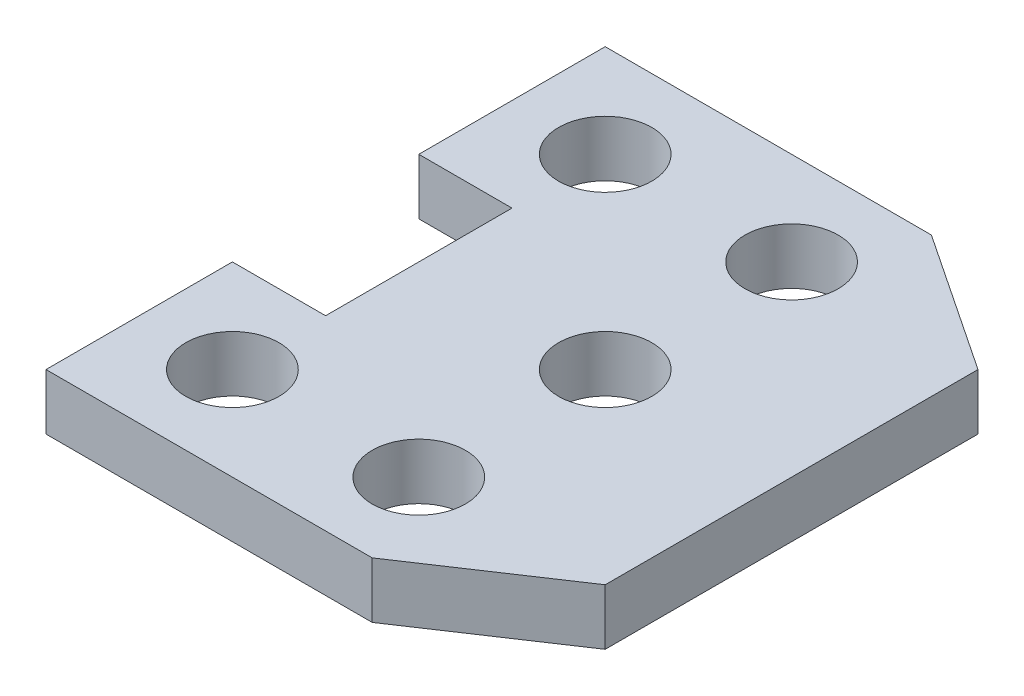
ISO-10303-21;
HEADER;
FILE_DESCRIPTION(('STEP AP214'),'2;1');
FILE_NAME('part.step','',(''),(''),'','','');
FILE_SCHEMA(('AUTOMOTIVE_DESIGN { 1 0 10303 214 1 1 1 1 }'));
ENDSEC;
DATA;
#1=APPLICATION_CONTEXT('core data for automotive mechanical design processes');
#2=APPLICATION_PROTOCOL_DEFINITION('international standard','automotive_design',2000,#1);
#3=PRODUCT_CONTEXT('',#1,'mechanical');
#4=PRODUCT('Part','Part','',(#3));
#5=PRODUCT_RELATED_PRODUCT_CATEGORY('part','',(#4));
#6=PRODUCT_DEFINITION_FORMATION('','',#4);
#7=PRODUCT_DEFINITION_CONTEXT('part definition',#1,'design');
#8=PRODUCT_DEFINITION('design','',#6,#7);
#9=PRODUCT_DEFINITION_SHAPE('','',#8);
#10=(LENGTH_UNIT() NAMED_UNIT(*) SI_UNIT(.MILLI.,.METRE.));
#11=(NAMED_UNIT(*) PLANE_ANGLE_UNIT() SI_UNIT($,.RADIAN.));
#12=(NAMED_UNIT(*) SI_UNIT($,.STERADIAN.) SOLID_ANGLE_UNIT());
#13=UNCERTAINTY_MEASURE_WITH_UNIT(LENGTH_MEASURE(1.E-05),#10,'distance_accuracy_value','');
#14=(GEOMETRIC_REPRESENTATION_CONTEXT(3) GLOBAL_UNCERTAINTY_ASSIGNED_CONTEXT((#13)) GLOBAL_UNIT_ASSIGNED_CONTEXT((#10,
#11,#12)) REPRESENTATION_CONTEXT('',''));
#15=CARTESIAN_POINT('',(0.,0.,0.));
#16=DIRECTION('',(0.,0.,1.));
#17=DIRECTION('',(1.,0.,0.));
#18=AXIS2_PLACEMENT_3D('',#15,#16,#17);
#19=CARTESIAN_POINT('',(0.,12.,0.));
#20=DIRECTION('',(0.,-1.,0.));
#21=DIRECTION('',(0.,0.,-1.));
#22=AXIS2_PLACEMENT_3D('',#19,#20,#21);
#23=PLANE('',#22);
#24=DIRECTION('',(0.832050294337844,0.,-0.554700196225229));
#25=VECTOR('',#24,1.);
#26=CARTESIAN_POINT('',(0.,12.,0.));
#27=LINE('',#26,#25);
#28=CARTESIAN_POINT('',(0.,12.,0.));
#29=VERTEX_POINT('',#28);
#30=CARTESIAN_POINT('',(30.,12.,-20.));
#31=VERTEX_POINT('',#30);
#32=EDGE_CURVE('E164',#29,#31,#27,.T.);
#33=ORIENTED_EDGE('',*,*,#32,.T.);
#34=DIRECTION('',(0.,0.,-1.));
#35=VECTOR('',#34,1.);
#36=CARTESIAN_POINT('',(30.,12.,-100.));
#37=LINE('',#36,#35);
#38=CARTESIAN_POINT('',(30.,12.,-100.));
#39=VERTEX_POINT('',#38);
#40=EDGE_CURVE('E102',#31,#39,#37,.T.);
#41=ORIENTED_EDGE('',*,*,#40,.T.);
#42=DIRECTION('',(-0.832050294337845,0.,-0.554700196225227));
#43=VECTOR('',#42,1.);
#44=CARTESIAN_POINT('',(-1.76941794549634E-13,12.,-120.));
#45=LINE('',#44,#43);
#46=CARTESIAN_POINT('',(-1.76941794549634E-13,12.,-120.));
#47=VERTEX_POINT('',#46);
#48=EDGE_CURVE('E185',#39,#47,#45,.T.);
#49=ORIENTED_EDGE('',*,*,#48,.T.);
#50=DIRECTION('',(-1.,0.,0.));
#51=VECTOR('',#50,1.);
#52=CARTESIAN_POINT('',(-70.,12.,-120.));
#53=LINE('',#52,#51);
#54=CARTESIAN_POINT('',(-70.,12.,-120.));
#55=VERTEX_POINT('',#54);
#56=EDGE_CURVE('E204',#47,#55,#53,.T.);
#57=ORIENTED_EDGE('',*,*,#56,.T.);
#58=DIRECTION('',(0.,0.,1.));
#59=VECTOR('',#58,1.);
#60=CARTESIAN_POINT('',(-70.,12.,-80.));
#61=LINE('',#60,#59);
#62=CARTESIAN_POINT('',(-70.,12.,-80.));
#63=VERTEX_POINT('',#62);
#64=EDGE_CURVE('E201',#55,#63,#61,.T.);
#65=ORIENTED_EDGE('',*,*,#64,.T.);
#66=DIRECTION('',(1.,0.,0.));
#67=VECTOR('',#66,1.);
#68=CARTESIAN_POINT('',(-50.,12.,-80.));
#69=LINE('',#68,#67);
#70=CARTESIAN_POINT('',(-50.,12.,-80.));
#71=VERTEX_POINT('',#70);
#72=EDGE_CURVE('E203',#63,#71,#69,.T.);
#73=ORIENTED_EDGE('',*,*,#72,.T.);
#74=DIRECTION('',(0.,0.,1.));
#75=VECTOR('',#74,1.);
#76=CARTESIAN_POINT('',(-50.,12.,-40.));
#77=LINE('',#76,#75);
#78=CARTESIAN_POINT('',(-50.,12.,-40.));
#79=VERTEX_POINT('',#78);
#80=EDGE_CURVE('E127',#71,#79,#77,.T.);
#81=ORIENTED_EDGE('',*,*,#80,.T.);
#82=DIRECTION('',(-1.,0.,0.));
#83=VECTOR('',#82,1.);
#84=CARTESIAN_POINT('',(-70.,12.,-40.));
#85=LINE('',#84,#83);
#86=CARTESIAN_POINT('',(-70.,12.,-40.));
#87=VERTEX_POINT('',#86);
#88=EDGE_CURVE('E121',#79,#87,#85,.T.);
#89=ORIENTED_EDGE('',*,*,#88,.T.);
#90=DIRECTION('',(0.,0.,1.));
#91=VECTOR('',#90,1.);
#92=CARTESIAN_POINT('',(-70.,12.,0.));
#93=LINE('',#92,#91);
#94=CARTESIAN_POINT('',(-70.,12.,0.));
#95=VERTEX_POINT('',#94);
#96=EDGE_CURVE('E125',#87,#95,#93,.T.);
#97=ORIENTED_EDGE('',*,*,#96,.T.);
#98=DIRECTION('',(1.,0.,0.));
#99=VECTOR('',#98,1.);
#100=CARTESIAN_POINT('',(0.,12.,0.));
#101=LINE('',#100,#99);
#102=EDGE_CURVE('E53',#95,#29,#101,.T.);
#103=ORIENTED_EDGE('',*,*,#102,.T.);
#104=EDGE_LOOP('',(#33,#41,#49,#57,#65,#73,#81,#89,#97,#103));
#105=FACE_BOUND('',#104,.T.);
#106=CARTESIAN_POINT('',(-10.,12.,-100.));
#107=DIRECTION('',(0.,1.,0.));
#108=DIRECTION('',(0.,0.,1.));
#109=AXIS2_PLACEMENT_3D('',#106,#107,#108);
#110=CIRCLE('',#109,10.);
#111=CARTESIAN_POINT('',(-10.,12.,-90.));
#112=VERTEX_POINT('',#111);
#113=EDGE_CURVE('E149',#112,#112,#110,.T.);
#114=ORIENTED_EDGE('',*,*,#113,.F.);
#115=EDGE_LOOP('',(#114));
#116=FACE_BOUND('',#115,.T.);
#117=CARTESIAN_POINT('',(-50.,12.,-100.));
#118=DIRECTION('',(0.,1.,0.));
#119=DIRECTION('',(0.,0.,1.));
#120=AXIS2_PLACEMENT_3D('',#117,#118,#119);
#121=CIRCLE('',#120,10.);
#122=CARTESIAN_POINT('',(-50.,12.,-90.));
#123=VERTEX_POINT('',#122);
#124=EDGE_CURVE('E215',#123,#123,#121,.T.);
#125=ORIENTED_EDGE('',*,*,#124,.F.);
#126=EDGE_LOOP('',(#125));
#127=FACE_BOUND('',#126,.T.);
#128=CARTESIAN_POINT('',(-50.,12.,-20.));
#129=DIRECTION('',(0.,1.,0.));
#130=DIRECTION('',(0.,0.,1.));
#131=AXIS2_PLACEMENT_3D('',#128,#129,#130);
#132=CIRCLE('',#131,10.);
#133=CARTESIAN_POINT('',(-50.,12.,-9.99999999999999));
#134=VERTEX_POINT('',#133);
#135=EDGE_CURVE('E221',#134,#134,#132,.T.);
#136=ORIENTED_EDGE('',*,*,#135,.F.);
#137=EDGE_LOOP('',(#136));
#138=FACE_BOUND('',#137,.T.);
#139=CARTESIAN_POINT('',(-10.,12.,-20.));
#140=DIRECTION('',(0.,1.,0.));
#141=DIRECTION('',(0.,0.,1.));
#142=AXIS2_PLACEMENT_3D('',#139,#140,#141);
#143=CIRCLE('',#142,10.);
#144=CARTESIAN_POINT('',(-10.,12.,-9.99999999999999));
#145=VERTEX_POINT('',#144);
#146=EDGE_CURVE('E227',#145,#145,#143,.T.);
#147=ORIENTED_EDGE('',*,*,#146,.F.);
#148=EDGE_LOOP('',(#147));
#149=FACE_BOUND('',#148,.T.);
#150=CARTESIAN_POINT('',(-10.,12.,-60.));
#151=DIRECTION('',(0.,1.,0.));
#152=DIRECTION('',(0.,0.,1.));
#153=AXIS2_PLACEMENT_3D('',#150,#151,#152);
#154=CIRCLE('',#153,10.);
#155=CARTESIAN_POINT('',(-10.,12.,-50.));
#156=VERTEX_POINT('',#155);
#157=EDGE_CURVE('E233',#156,#156,#154,.T.);
#158=ORIENTED_EDGE('',*,*,#157,.F.);
#159=EDGE_LOOP('',(#158));
#160=FACE_BOUND('',#159,.T.);
#161=ADVANCED_FACE('F36',(#105,#116,#127,#138,#149,#160),#23,.F.);
#162=CARTESIAN_POINT('',(0.,0.,0.));
#163=DIRECTION('',(0.,-1.,0.));
#164=DIRECTION('',(0.,0.,-1.));
#165=AXIS2_PLACEMENT_3D('',#162,#163,#164);
#166=PLANE('',#165);
#167=CARTESIAN_POINT('',(-10.,0.,-20.));
#168=DIRECTION('',(0.,1.,0.));
#169=DIRECTION('',(0.,0.,1.));
#170=AXIS2_PLACEMENT_3D('',#167,#168,#169);
#171=CIRCLE('',#170,10.);
#172=CARTESIAN_POINT('',(-10.,0.,-9.99999999999999));
#173=VERTEX_POINT('',#172);
#174=EDGE_CURVE('E230',#173,#173,#171,.T.);
#175=ORIENTED_EDGE('',*,*,#174,.T.);
#176=EDGE_LOOP('',(#175));
#177=FACE_BOUND('',#176,.T.);
#178=CARTESIAN_POINT('',(-50.,0.,-100.));
#179=DIRECTION('',(0.,1.,0.));
#180=DIRECTION('',(0.,0.,1.));
#181=AXIS2_PLACEMENT_3D('',#178,#179,#180);
#182=CIRCLE('',#181,10.);
#183=CARTESIAN_POINT('',(-50.,0.,-90.));
#184=VERTEX_POINT('',#183);
#185=EDGE_CURVE('E218',#184,#184,#182,.T.);
#186=ORIENTED_EDGE('',*,*,#185,.T.);
#187=EDGE_LOOP('',(#186));
#188=FACE_BOUND('',#187,.T.);
#189=DIRECTION('',(0.832050294337844,0.,-0.554700196225229));
#190=VECTOR('',#189,1.);
#191=CARTESIAN_POINT('',(0.,0.,0.));
#192=LINE('',#191,#190);
#193=CARTESIAN_POINT('',(0.,0.,0.));
#194=VERTEX_POINT('',#193);
#195=CARTESIAN_POINT('',(30.,0.,-20.));
#196=VERTEX_POINT('',#195);
#197=EDGE_CURVE('E145',#194,#196,#192,.T.);
#198=ORIENTED_EDGE('',*,*,#197,.F.);
#199=DIRECTION('',(1.,0.,0.));
#200=VECTOR('',#199,1.);
#201=CARTESIAN_POINT('',(0.,0.,0.));
#202=LINE('',#201,#200);
#203=CARTESIAN_POINT('',(-70.,0.,0.));
#204=VERTEX_POINT('',#203);
#205=EDGE_CURVE('E94',#204,#194,#202,.T.);
#206=ORIENTED_EDGE('',*,*,#205,.F.);
#207=DIRECTION('',(0.,0.,1.));
#208=VECTOR('',#207,1.);
#209=CARTESIAN_POINT('',(-70.,0.,0.));
#210=LINE('',#209,#208);
#211=CARTESIAN_POINT('',(-70.,0.,-40.));
#212=VERTEX_POINT('',#211);
#213=EDGE_CURVE('E88',#212,#204,#210,.T.);
#214=ORIENTED_EDGE('',*,*,#213,.F.);
#215=DIRECTION('',(-1.,0.,0.));
#216=VECTOR('',#215,1.);
#217=CARTESIAN_POINT('',(-70.,0.,-40.));
#218=LINE('',#217,#216);
#219=CARTESIAN_POINT('',(-50.,0.,-40.));
#220=VERTEX_POINT('',#219);
#221=EDGE_CURVE('E135',#220,#212,#218,.T.);
#222=ORIENTED_EDGE('',*,*,#221,.F.);
#223=DIRECTION('',(0.,0.,1.));
#224=VECTOR('',#223,1.);
#225=CARTESIAN_POINT('',(-50.,0.,-40.));
#226=LINE('',#225,#224);
#227=CARTESIAN_POINT('',(-50.,0.,-80.));
#228=VERTEX_POINT('',#227);
#229=EDGE_CURVE('E159',#228,#220,#226,.T.);
#230=ORIENTED_EDGE('',*,*,#229,.F.);
#231=DIRECTION('',(1.,0.,0.));
#232=VECTOR('',#231,1.);
#233=CARTESIAN_POINT('',(-50.,0.,-80.));
#234=LINE('',#233,#232);
#235=CARTESIAN_POINT('',(-70.,0.,-80.));
#236=VERTEX_POINT('',#235);
#237=EDGE_CURVE('E157',#236,#228,#234,.T.);
#238=ORIENTED_EDGE('',*,*,#237,.F.);
#239=DIRECTION('',(0.,0.,1.));
#240=VECTOR('',#239,1.);
#241=CARTESIAN_POINT('',(-70.,0.,-80.));
#242=LINE('',#241,#240);
#243=CARTESIAN_POINT('',(-70.,0.,-120.));
#244=VERTEX_POINT('',#243);
#245=EDGE_CURVE('E155',#244,#236,#242,.T.);
#246=ORIENTED_EDGE('',*,*,#245,.F.);
#247=DIRECTION('',(-1.,0.,0.));
#248=VECTOR('',#247,1.);
#249=CARTESIAN_POINT('',(-70.,0.,-120.));
#250=LINE('',#249,#248);
#251=CARTESIAN_POINT('',(-1.76941794549634E-13,0.,-120.));
#252=VERTEX_POINT('',#251);
#253=EDGE_CURVE('E153',#252,#244,#250,.T.);
#254=ORIENTED_EDGE('',*,*,#253,.F.);
#255=DIRECTION('',(-0.832050294337845,0.,-0.554700196225227));
#256=VECTOR('',#255,1.);
#257=CARTESIAN_POINT('',(-1.76941794549634E-13,0.,-120.));
#258=LINE('',#257,#256);
#259=CARTESIAN_POINT('',(30.,0.,-100.));
#260=VERTEX_POINT('',#259);
#261=EDGE_CURVE('E151',#260,#252,#258,.T.);
#262=ORIENTED_EDGE('',*,*,#261,.F.);
#263=DIRECTION('',(0.,0.,-1.));
#264=VECTOR('',#263,1.);
#265=CARTESIAN_POINT('',(30.,0.,-100.));
#266=LINE('',#265,#264);
#267=EDGE_CURVE('E148',#196,#260,#266,.T.);
#268=ORIENTED_EDGE('',*,*,#267,.F.);
#269=EDGE_LOOP('',(#198,#206,#214,#222,#230,#238,#246,#254,#262,#268));
#270=FACE_BOUND('',#269,.T.);
#271=CARTESIAN_POINT('',(-10.,0.,-100.));
#272=DIRECTION('',(0.,1.,0.));
#273=DIRECTION('',(0.,0.,1.));
#274=AXIS2_PLACEMENT_3D('',#271,#272,#273);
#275=CIRCLE('',#274,10.);
#276=CARTESIAN_POINT('',(-10.,0.,-90.));
#277=VERTEX_POINT('',#276);
#278=EDGE_CURVE('E212',#277,#277,#275,.T.);
#279=ORIENTED_EDGE('',*,*,#278,.T.);
#280=EDGE_LOOP('',(#279));
#281=FACE_BOUND('',#280,.T.);
#282=CARTESIAN_POINT('',(-50.,0.,-20.));
#283=DIRECTION('',(0.,1.,0.));
#284=DIRECTION('',(0.,0.,1.));
#285=AXIS2_PLACEMENT_3D('',#282,#283,#284);
#286=CIRCLE('',#285,10.);
#287=CARTESIAN_POINT('',(-50.,0.,-9.99999999999999));
#288=VERTEX_POINT('',#287);
#289=EDGE_CURVE('E224',#288,#288,#286,.T.);
#290=ORIENTED_EDGE('',*,*,#289,.T.);
#291=EDGE_LOOP('',(#290));
#292=FACE_BOUND('',#291,.T.);
#293=CARTESIAN_POINT('',(-10.,0.,-60.));
#294=DIRECTION('',(0.,1.,0.));
#295=DIRECTION('',(0.,0.,1.));
#296=AXIS2_PLACEMENT_3D('',#293,#294,#295);
#297=CIRCLE('',#296,10.);
#298=CARTESIAN_POINT('',(-10.,0.,-50.));
#299=VERTEX_POINT('',#298);
#300=EDGE_CURVE('E236',#299,#299,#297,.T.);
#301=ORIENTED_EDGE('',*,*,#300,.T.);
#302=EDGE_LOOP('',(#301));
#303=FACE_BOUND('',#302,.T.);
#304=ADVANCED_FACE('F189',(#177,#188,#270,#281,#292,#303),#166,.T.);
#305=CARTESIAN_POINT('',(0.,12.,0.));
#306=DIRECTION('',(-0.554700196225229,0.,-0.832050294337844));
#307=DIRECTION('',(-0.832050294337844,0.,0.554700196225229));
#308=AXIS2_PLACEMENT_3D('',#305,#306,#307);
#309=PLANE('',#308);
#310=ORIENTED_EDGE('',*,*,#197,.T.);
#311=DIRECTION('',(0.,-1.,0.));
#312=VECTOR('',#311,1.);
#313=CARTESIAN_POINT('',(30.,12.,-20.));
#314=LINE('',#313,#312);
#315=EDGE_CURVE('E11',#31,#196,#314,.T.);
#316=ORIENTED_EDGE('',*,*,#315,.F.);
#317=ORIENTED_EDGE('',*,*,#32,.F.);
#318=DIRECTION('',(0.,-1.,0.));
#319=VECTOR('',#318,1.);
#320=CARTESIAN_POINT('',(0.,12.,0.));
#321=LINE('',#320,#319);
#322=EDGE_CURVE('E141',#29,#194,#321,.T.);
#323=ORIENTED_EDGE('',*,*,#322,.T.);
#324=EDGE_LOOP('',(#310,#316,#317,#323));
#325=FACE_BOUND('',#324,.T.);
#326=ADVANCED_FACE('F38',(#325),#309,.F.);
#327=CARTESIAN_POINT('',(30.,12.,-100.));
#328=DIRECTION('',(-1.,0.,0.));
#329=DIRECTION('',(0.,0.,1.));
#330=AXIS2_PLACEMENT_3D('',#327,#328,#329);
#331=PLANE('',#330);
#332=ORIENTED_EDGE('',*,*,#267,.T.);
#333=DIRECTION('',(0.,-1.,0.));
#334=VECTOR('',#333,1.);
#335=CARTESIAN_POINT('',(30.,12.,-100.));
#336=LINE('',#335,#334);
#337=EDGE_CURVE('E45',#39,#260,#336,.T.);
#338=ORIENTED_EDGE('',*,*,#337,.F.);
#339=ORIENTED_EDGE('',*,*,#40,.F.);
#340=ORIENTED_EDGE('',*,*,#315,.T.);
#341=EDGE_LOOP('',(#332,#338,#339,#340));
#342=FACE_BOUND('',#341,.T.);
#343=ADVANCED_FACE('F276',(#342),#331,.F.);
#344=CARTESIAN_POINT('',(-1.76941794549634E-13,12.,-120.));
#345=DIRECTION('',(-0.554700196225227,0.,0.832050294337845));
#346=DIRECTION('',(0.832050294337845,0.,0.554700196225227));
#347=AXIS2_PLACEMENT_3D('',#344,#345,#346);
#348=PLANE('',#347);
#349=ORIENTED_EDGE('',*,*,#261,.T.);
#350=DIRECTION('',(0.,-1.,0.));
#351=VECTOR('',#350,1.);
#352=CARTESIAN_POINT('',(-1.76941794549634E-13,12.,-120.));
#353=LINE('',#352,#351);
#354=EDGE_CURVE('E177',#47,#252,#353,.T.);
#355=ORIENTED_EDGE('',*,*,#354,.F.);
#356=ORIENTED_EDGE('',*,*,#48,.F.);
#357=ORIENTED_EDGE('',*,*,#337,.T.);
#358=EDGE_LOOP('',(#349,#355,#356,#357));
#359=FACE_BOUND('',#358,.T.);
#360=ADVANCED_FACE('F183',(#359),#348,.F.);
#361=CARTESIAN_POINT('',(-70.,12.,-120.));
#362=DIRECTION('',(0.,0.,1.));
#363=DIRECTION('',(1.,0.,0.));
#364=AXIS2_PLACEMENT_3D('',#361,#362,#363);
#365=PLANE('',#364);
#366=ORIENTED_EDGE('',*,*,#253,.T.);
#367=DIRECTION('',(0.,-1.,0.));
#368=VECTOR('',#367,1.);
#369=CARTESIAN_POINT('',(-70.,12.,-120.));
#370=LINE('',#369,#368);
#371=EDGE_CURVE('E174',#55,#244,#370,.T.);
#372=ORIENTED_EDGE('',*,*,#371,.F.);
#373=ORIENTED_EDGE('',*,*,#56,.F.);
#374=ORIENTED_EDGE('',*,*,#354,.T.);
#375=EDGE_LOOP('',(#366,#372,#373,#374));
#376=FACE_BOUND('',#375,.T.);
#377=ADVANCED_FACE('F195',(#376),#365,.F.);
#378=CARTESIAN_POINT('',(-70.,12.,-80.));
#379=DIRECTION('',(1.,0.,0.));
#380=DIRECTION('',(0.,0.,-1.));
#381=AXIS2_PLACEMENT_3D('',#378,#379,#380);
#382=PLANE('',#381);
#383=ORIENTED_EDGE('',*,*,#245,.T.);
#384=DIRECTION('',(0.,-1.,0.));
#385=VECTOR('',#384,1.);
#386=CARTESIAN_POINT('',(-70.,12.,-80.));
#387=LINE('',#386,#385);
#388=EDGE_CURVE('E171',#63,#236,#387,.T.);
#389=ORIENTED_EDGE('',*,*,#388,.F.);
#390=ORIENTED_EDGE('',*,*,#64,.F.);
#391=ORIENTED_EDGE('',*,*,#371,.T.);
#392=EDGE_LOOP('',(#383,#389,#390,#391));
#393=FACE_BOUND('',#392,.T.);
#394=ADVANCED_FACE('F199',(#393),#382,.F.);
#395=CARTESIAN_POINT('',(-50.,12.,-80.));
#396=DIRECTION('',(0.,0.,-1.));
#397=DIRECTION('',(-1.,0.,0.));
#398=AXIS2_PLACEMENT_3D('',#395,#396,#397);
#399=PLANE('',#398);
#400=ORIENTED_EDGE('',*,*,#237,.T.);
#401=DIRECTION('',(0.,-1.,0.));
#402=VECTOR('',#401,1.);
#403=CARTESIAN_POINT('',(-50.,12.,-80.));
#404=LINE('',#403,#402);
#405=EDGE_CURVE('E168',#71,#228,#404,.T.);
#406=ORIENTED_EDGE('',*,*,#405,.F.);
#407=ORIENTED_EDGE('',*,*,#72,.F.);
#408=ORIENTED_EDGE('',*,*,#388,.T.);
#409=EDGE_LOOP('',(#400,#406,#407,#408));
#410=FACE_BOUND('',#409,.T.);
#411=ADVANCED_FACE('F266',(#410),#399,.F.);
#412=CARTESIAN_POINT('',(-50.,12.,-40.));
#413=DIRECTION('',(1.,0.,0.));
#414=DIRECTION('',(0.,0.,-1.));
#415=AXIS2_PLACEMENT_3D('',#412,#413,#414);
#416=PLANE('',#415);
#417=ORIENTED_EDGE('',*,*,#229,.T.);
#418=DIRECTION('',(0.,-1.,0.));
#419=VECTOR('',#418,1.);
#420=CARTESIAN_POINT('',(-50.,12.,-40.));
#421=LINE('',#420,#419);
#422=EDGE_CURVE('E136',#79,#220,#421,.T.);
#423=ORIENTED_EDGE('',*,*,#422,.F.);
#424=ORIENTED_EDGE('',*,*,#80,.F.);
#425=ORIENTED_EDGE('',*,*,#405,.T.);
#426=EDGE_LOOP('',(#417,#423,#424,#425));
#427=FACE_BOUND('',#426,.T.);
#428=ADVANCED_FACE('F263',(#427),#416,.F.);
#429=CARTESIAN_POINT('',(-70.,12.,-40.));
#430=DIRECTION('',(0.,0.,1.));
#431=DIRECTION('',(1.,0.,0.));
#432=AXIS2_PLACEMENT_3D('',#429,#430,#431);
#433=PLANE('',#432);
#434=ORIENTED_EDGE('',*,*,#221,.T.);
#435=DIRECTION('',(0.,-1.,0.));
#436=VECTOR('',#435,1.);
#437=CARTESIAN_POINT('',(-70.,12.,-40.));
#438=LINE('',#437,#436);
#439=EDGE_CURVE('E132',#87,#212,#438,.T.);
#440=ORIENTED_EDGE('',*,*,#439,.F.);
#441=ORIENTED_EDGE('',*,*,#88,.F.);
#442=ORIENTED_EDGE('',*,*,#422,.T.);
#443=EDGE_LOOP('',(#434,#440,#441,#442));
#444=FACE_BOUND('',#443,.T.);
#445=ADVANCED_FACE('F133',(#444),#433,.F.);
#446=CARTESIAN_POINT('',(-70.,12.,0.));
#447=DIRECTION('',(1.,0.,0.));
#448=DIRECTION('',(0.,0.,-1.));
#449=AXIS2_PLACEMENT_3D('',#446,#447,#448);
#450=PLANE('',#449);
#451=ORIENTED_EDGE('',*,*,#213,.T.);
#452=DIRECTION('',(0.,-1.,0.));
#453=VECTOR('',#452,1.);
#454=CARTESIAN_POINT('',(-70.,12.,0.));
#455=LINE('',#454,#453);
#456=EDGE_CURVE('E137',#95,#204,#455,.T.);
#457=ORIENTED_EDGE('',*,*,#456,.F.);
#458=ORIENTED_EDGE('',*,*,#96,.F.);
#459=ORIENTED_EDGE('',*,*,#439,.T.);
#460=EDGE_LOOP('',(#451,#457,#458,#459));
#461=FACE_BOUND('',#460,.T.);
#462=ADVANCED_FACE('F139',(#461),#450,.F.);
#463=CARTESIAN_POINT('',(0.,12.,0.));
#464=DIRECTION('',(0.,0.,-1.));
#465=DIRECTION('',(-1.,0.,0.));
#466=AXIS2_PLACEMENT_3D('',#463,#464,#465);
#467=PLANE('',#466);
#468=ORIENTED_EDGE('',*,*,#205,.T.);
#469=ORIENTED_EDGE('',*,*,#322,.F.);
#470=ORIENTED_EDGE('',*,*,#102,.F.);
#471=ORIENTED_EDGE('',*,*,#456,.T.);
#472=EDGE_LOOP('',(#468,#469,#470,#471));
#473=FACE_BOUND('',#472,.T.);
#474=ADVANCED_FACE('F256',(#473),#467,.F.);
#475=CARTESIAN_POINT('',(-10.,12.,-100.));
#476=DIRECTION('',(0.,-1.,0.));
#477=DIRECTION('',(0.,0.,-1.));
#478=AXIS2_PLACEMENT_3D('',#475,#476,#477);
#479=CYLINDRICAL_SURFACE('',#478,10.);
#480=ORIENTED_EDGE('',*,*,#113,.T.);
#481=EDGE_LOOP('',(#480));
#482=FACE_BOUND('',#481,.T.);
#483=ORIENTED_EDGE('',*,*,#278,.F.);
#484=EDGE_LOOP('',(#483));
#485=FACE_BOUND('',#484,.T.);
#486=ADVANCED_FACE('F253',(#482,#485),#479,.F.);
#487=CARTESIAN_POINT('',(-50.,12.,-100.));
#488=DIRECTION('',(0.,-1.,0.));
#489=DIRECTION('',(0.,0.,-1.));
#490=AXIS2_PLACEMENT_3D('',#487,#488,#489);
#491=CYLINDRICAL_SURFACE('',#490,10.);
#492=ORIENTED_EDGE('',*,*,#124,.T.);
#493=EDGE_LOOP('',(#492));
#494=FACE_BOUND('',#493,.T.);
#495=ORIENTED_EDGE('',*,*,#185,.F.);
#496=EDGE_LOOP('',(#495));
#497=FACE_BOUND('',#496,.T.);
#498=ADVANCED_FACE('F352',(#494,#497),#491,.F.);
#499=CARTESIAN_POINT('',(-50.,12.,-20.));
#500=DIRECTION('',(0.,-1.,0.));
#501=DIRECTION('',(0.,0.,-1.));
#502=AXIS2_PLACEMENT_3D('',#499,#500,#501);
#503=CYLINDRICAL_SURFACE('',#502,10.);
#504=ORIENTED_EDGE('',*,*,#135,.T.);
#505=EDGE_LOOP('',(#504));
#506=FACE_BOUND('',#505,.T.);
#507=ORIENTED_EDGE('',*,*,#289,.F.);
#508=EDGE_LOOP('',(#507));
#509=FACE_BOUND('',#508,.T.);
#510=ADVANCED_FACE('F360',(#506,#509),#503,.F.);
#511=CARTESIAN_POINT('',(-10.,12.,-20.));
#512=DIRECTION('',(0.,-1.,0.));
#513=DIRECTION('',(0.,0.,-1.));
#514=AXIS2_PLACEMENT_3D('',#511,#512,#513);
#515=CYLINDRICAL_SURFACE('',#514,10.);
#516=ORIENTED_EDGE('',*,*,#146,.T.);
#517=EDGE_LOOP('',(#516));
#518=FACE_BOUND('',#517,.T.);
#519=ORIENTED_EDGE('',*,*,#174,.F.);
#520=EDGE_LOOP('',(#519));
#521=FACE_BOUND('',#520,.T.);
#522=ADVANCED_FACE('F368',(#518,#521),#515,.F.);
#523=CARTESIAN_POINT('',(-10.,12.,-60.));
#524=DIRECTION('',(0.,-1.,0.));
#525=DIRECTION('',(0.,0.,-1.));
#526=AXIS2_PLACEMENT_3D('',#523,#524,#525);
#527=CYLINDRICAL_SURFACE('',#526,10.);
#528=ORIENTED_EDGE('',*,*,#157,.T.);
#529=EDGE_LOOP('',(#528));
#530=FACE_BOUND('',#529,.T.);
#531=ORIENTED_EDGE('',*,*,#300,.F.);
#532=EDGE_LOOP('',(#531));
#533=FACE_BOUND('',#532,.T.);
#534=ADVANCED_FACE('F242',(#530,#533),#527,.F.);
#535=CLOSED_SHELL('',(#161,#304,#326,#343,#360,#377,#394,#411,#428,#445,#462,#474,#486,#498,
#510,#522,#534));
#536=MANIFOLD_SOLID_BREP('B2',#535);
#537=ADVANCED_BREP_SHAPE_REPRESENTATION('',(#18,#536),#14);
#538=SHAPE_DEFINITION_REPRESENTATION(#9,#537);
ENDSEC;
END-ISO-10303-21;
